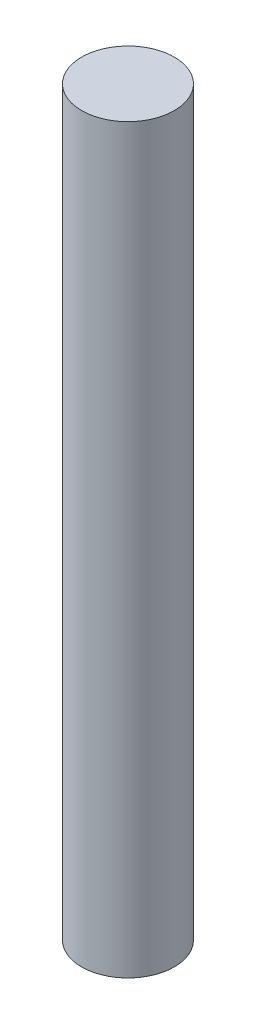
ISO-10303-21;
HEADER;
FILE_DESCRIPTION(('STEP AP214'),'2;1');
FILE_NAME('part.step','',(''),(''),'','','');
FILE_SCHEMA(('AUTOMOTIVE_DESIGN { 1 0 10303 214 1 1 1 1 }'));
ENDSEC;
DATA;
#1=APPLICATION_CONTEXT('core data for automotive mechanical design processes');
#2=APPLICATION_PROTOCOL_DEFINITION('international standard','automotive_design',2000,#1);
#3=PRODUCT_CONTEXT('',#1,'mechanical');
#4=PRODUCT('Part','Part','',(#3));
#5=PRODUCT_RELATED_PRODUCT_CATEGORY('part','',(#4));
#6=PRODUCT_DEFINITION_FORMATION('','',#4);
#7=PRODUCT_DEFINITION_CONTEXT('part definition',#1,'design');
#8=PRODUCT_DEFINITION('design','',#6,#7);
#9=PRODUCT_DEFINITION_SHAPE('','',#8);
#10=(LENGTH_UNIT() NAMED_UNIT(*) SI_UNIT(.MILLI.,.METRE.));
#11=(NAMED_UNIT(*) PLANE_ANGLE_UNIT() SI_UNIT($,.RADIAN.));
#12=(NAMED_UNIT(*) SI_UNIT($,.STERADIAN.) SOLID_ANGLE_UNIT());
#13=UNCERTAINTY_MEASURE_WITH_UNIT(LENGTH_MEASURE(1.E-05),#10,'distance_accuracy_value','');
#14=(GEOMETRIC_REPRESENTATION_CONTEXT(3) GLOBAL_UNCERTAINTY_ASSIGNED_CONTEXT((#13)) GLOBAL_UNIT_ASSIGNED_CONTEXT((#10,
#11,#12)) REPRESENTATION_CONTEXT('',''));
#15=CARTESIAN_POINT('',(0.,0.,0.));
#16=DIRECTION('',(0.,0.,1.));
#17=DIRECTION('',(1.,0.,0.));
#18=AXIS2_PLACEMENT_3D('',#15,#16,#17);
#19=CARTESIAN_POINT('',(-58.6013140302673,12.7,3.17500000000109));
#20=DIRECTION('',(0.,-1.,0.));
#21=DIRECTION('',(0.,0.,-1.));
#22=AXIS2_PLACEMENT_3D('',#19,#20,#21);
#23=CYLINDRICAL_SURFACE('',#22,1.58750000000002);
#24=CARTESIAN_POINT('',(-58.6013140302673,12.7,3.17500000000109));
#25=DIRECTION('',(0.,1.,0.));
#26=DIRECTION('',(0.,0.,1.));
#27=AXIS2_PLACEMENT_3D('',#24,#25,#26);
#28=CIRCLE('',#27,1.58750000000002);
#29=CARTESIAN_POINT('',(-58.6013140302673,12.7,4.76250000000111));
#30=VERTEX_POINT('',#29);
#31=EDGE_CURVE('E10',#30,#30,#28,.T.);
#32=ORIENTED_EDGE('',*,*,#31,.F.);
#33=EDGE_LOOP('',(#32));
#34=FACE_BOUND('',#33,.T.);
#35=CARTESIAN_POINT('',(-58.6013140302673,-12.7,3.17500000000109));
#36=DIRECTION('',(0.,1.,0.));
#37=DIRECTION('',(0.,0.,1.));
#38=AXIS2_PLACEMENT_3D('',#35,#36,#37);
#39=CIRCLE('',#38,1.58750000000002);
#40=CARTESIAN_POINT('',(-58.6013140302673,-12.7,4.76250000000111));
#41=VERTEX_POINT('',#40);
#42=EDGE_CURVE('E18',#41,#41,#39,.T.);
#43=ORIENTED_EDGE('',*,*,#42,.T.);
#44=EDGE_LOOP('',(#43));
#45=FACE_BOUND('',#44,.T.);
#46=ADVANCED_FACE('F15',(#34,#45),#23,.T.);
#47=CARTESIAN_POINT('',(-58.6013140302673,12.7,3.17500000000109));
#48=DIRECTION('',(0.,1.,0.));
#49=DIRECTION('',(0.,0.,1.));
#50=AXIS2_PLACEMENT_3D('',#47,#48,#49);
#51=PLANE('',#50);
#52=ORIENTED_EDGE('',*,*,#31,.T.);
#53=EDGE_LOOP('',(#52));
#54=FACE_BOUND('',#53,.T.);
#55=ADVANCED_FACE('F30',(#54),#51,.T.);
#56=CARTESIAN_POINT('',(-58.6013140302673,-12.7,3.17500000000109));
#57=DIRECTION('',(0.,1.,0.));
#58=DIRECTION('',(0.,0.,1.));
#59=AXIS2_PLACEMENT_3D('',#56,#57,#58);
#60=PLANE('',#59);
#61=ORIENTED_EDGE('',*,*,#42,.F.);
#62=EDGE_LOOP('',(#61));
#63=FACE_BOUND('',#62,.T.);
#64=ADVANCED_FACE('F28',(#63),#60,.F.);
#65=CLOSED_SHELL('',(#46,#55,#64));
#66=MANIFOLD_SOLID_BREP('B1',#65);
#67=ADVANCED_BREP_SHAPE_REPRESENTATION('',(#18,#66),#14);
#68=SHAPE_DEFINITION_REPRESENTATION(#9,#67);
ENDSEC;
END-ISO-10303-21;
